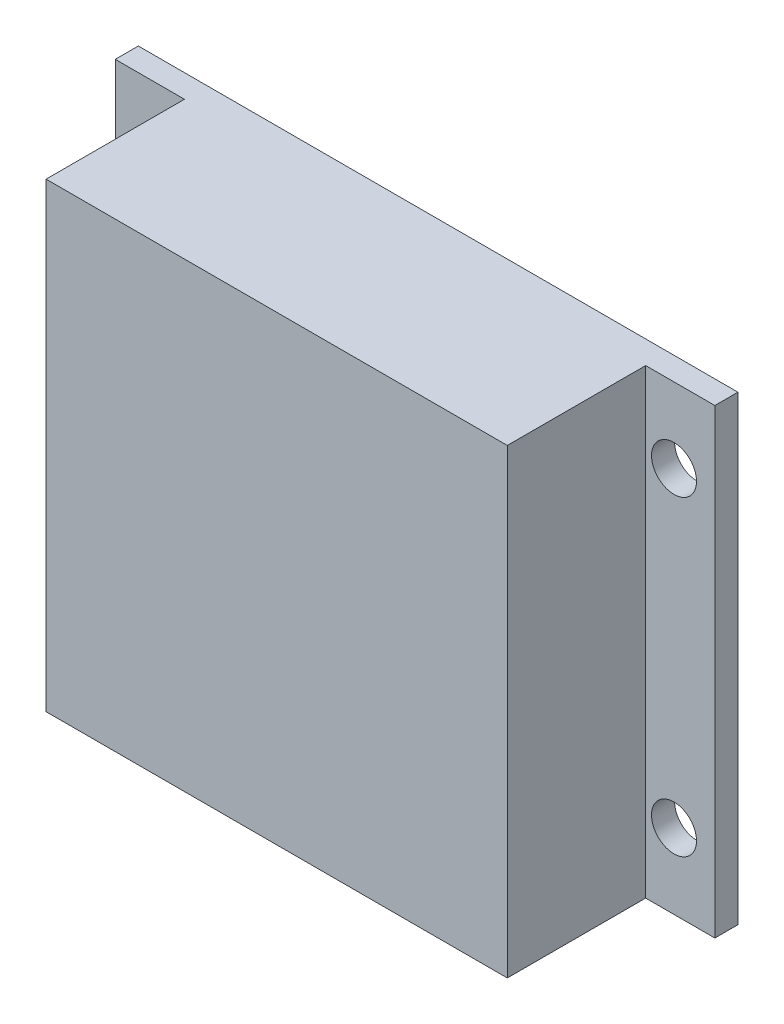
ISO-10303-21;
HEADER;
FILE_DESCRIPTION(('STEP AP214'),'2;1');
FILE_NAME('part.step','',(''),(''),'','','');
FILE_SCHEMA(('AUTOMOTIVE_DESIGN { 1 0 10303 214 1 1 1 1 }'));
ENDSEC;
DATA;
#1=APPLICATION_CONTEXT('core data for automotive mechanical design processes');
#2=APPLICATION_PROTOCOL_DEFINITION('international standard','automotive_design',2000,#1);
#3=PRODUCT_CONTEXT('',#1,'mechanical');
#4=PRODUCT('Part','Part','',(#3));
#5=PRODUCT_RELATED_PRODUCT_CATEGORY('part','',(#4));
#6=PRODUCT_DEFINITION_FORMATION('','',#4);
#7=PRODUCT_DEFINITION_CONTEXT('part definition',#1,'design');
#8=PRODUCT_DEFINITION('design','',#6,#7);
#9=PRODUCT_DEFINITION_SHAPE('','',#8);
#10=(LENGTH_UNIT() NAMED_UNIT(*) SI_UNIT(.MILLI.,.METRE.));
#11=(NAMED_UNIT(*) PLANE_ANGLE_UNIT() SI_UNIT($,.RADIAN.));
#12=(NAMED_UNIT(*) SI_UNIT($,.STERADIAN.) SOLID_ANGLE_UNIT());
#13=UNCERTAINTY_MEASURE_WITH_UNIT(LENGTH_MEASURE(1.E-05),#10,'distance_accuracy_value','');
#14=(GEOMETRIC_REPRESENTATION_CONTEXT(3) GLOBAL_UNCERTAINTY_ASSIGNED_CONTEXT((#13)) GLOBAL_UNIT_ASSIGNED_CONTEXT((#10,
#11,#12)) REPRESENTATION_CONTEXT('',''));
#15=CARTESIAN_POINT('',(0.,0.,0.));
#16=DIRECTION('',(0.,0.,1.));
#17=DIRECTION('',(1.,0.,0.));
#18=AXIS2_PLACEMENT_3D('',#15,#16,#17);
#19=CARTESIAN_POINT('',(0.,0.,1.));
#20=DIRECTION('',(0.,0.,-1.));
#21=DIRECTION('',(-1.,0.,0.));
#22=AXIS2_PLACEMENT_3D('',#19,#20,#21);
#23=PLANE('',#22);
#24=CARTESIAN_POINT('',(-11.23,-6.75,1.));
#25=DIRECTION('',(0.,0.,-1.));
#26=DIRECTION('',(1.,0.,0.));
#27=AXIS2_PLACEMENT_3D('',#24,#25,#26);
#28=CIRCLE('',#27,0.975);
#29=CARTESIAN_POINT('',(-10.255,-6.75,1.));
#30=VERTEX_POINT('',#29);
#31=EDGE_CURVE('E223',#30,#30,#28,.T.);
#32=ORIENTED_EDGE('',*,*,#31,.T.);
#33=EDGE_LOOP('',(#32));
#34=FACE_BOUND('',#33,.T.);
#35=CARTESIAN_POINT('',(-11.23,6.75,1.));
#36=DIRECTION('',(0.,0.,1.));
#37=DIRECTION('',(1.,0.,0.));
#38=AXIS2_PLACEMENT_3D('',#35,#36,#37);
#39=CIRCLE('',#38,0.975);
#40=CARTESIAN_POINT('',(-10.255,6.75,1.));
#41=VERTEX_POINT('',#40);
#42=EDGE_CURVE('E207',#41,#41,#39,.T.);
#43=ORIENTED_EDGE('',*,*,#42,.F.);
#44=EDGE_LOOP('',(#43));
#45=FACE_BOUND('',#44,.T.);
#46=DIRECTION('',(0.,-1.,0.));
#47=VECTOR('',#46,1.);
#48=CARTESIAN_POINT('',(-10.,-10.,1.));
#49=LINE('',#48,#47);
#50=CARTESIAN_POINT('',(-10.,10.,1.));
#51=VERTEX_POINT('',#50);
#52=CARTESIAN_POINT('',(-10.,-10.,1.));
#53=VERTEX_POINT('',#52);
#54=EDGE_CURVE('E56',#51,#53,#49,.T.);
#55=ORIENTED_EDGE('',*,*,#54,.F.);
#56=DIRECTION('',(-1.,0.,0.));
#57=VECTOR('',#56,1.);
#58=CARTESIAN_POINT('',(13.,10.,1.));
#59=LINE('',#58,#57);
#60=CARTESIAN_POINT('',(-13.,10.,1.));
#61=VERTEX_POINT('',#60);
#62=EDGE_CURVE('E147',#51,#61,#59,.T.);
#63=ORIENTED_EDGE('',*,*,#62,.T.);
#64=DIRECTION('',(0.,1.,0.));
#65=VECTOR('',#64,1.);
#66=CARTESIAN_POINT('',(-13.,-10.,1.));
#67=LINE('',#66,#65);
#68=CARTESIAN_POINT('',(-13.,-10.,1.));
#69=VERTEX_POINT('',#68);
#70=EDGE_CURVE('E143',#69,#61,#67,.T.);
#71=ORIENTED_EDGE('',*,*,#70,.F.);
#72=DIRECTION('',(-1.,0.,0.));
#73=VECTOR('',#72,1.);
#74=CARTESIAN_POINT('',(13.,-10.,1.));
#75=LINE('',#74,#73);
#76=EDGE_CURVE('E61',#53,#69,#75,.T.);
#77=ORIENTED_EDGE('',*,*,#76,.F.);
#78=EDGE_LOOP('',(#55,#63,#71,#77));
#79=FACE_BOUND('',#78,.T.);
#80=ADVANCED_FACE('F38',(#34,#45,#79),#23,.F.);
#81=CARTESIAN_POINT('',(11.23,-6.75,1.));
#82=DIRECTION('',(0.,0.,1.));
#83=DIRECTION('',(-1.,0.,0.));
#84=AXIS2_PLACEMENT_3D('',#81,#82,#83);
#85=CIRCLE('',#84,0.975);
#86=CARTESIAN_POINT('',(10.255,-6.75,1.));
#87=VERTEX_POINT('',#86);
#88=EDGE_CURVE('E231',#87,#87,#85,.T.);
#89=ORIENTED_EDGE('',*,*,#88,.F.);
#90=EDGE_LOOP('',(#89));
#91=FACE_BOUND('',#90,.T.);
#92=CARTESIAN_POINT('',(11.23,6.75,1.));
#93=DIRECTION('',(0.,0.,-1.));
#94=DIRECTION('',(-1.,0.,0.));
#95=AXIS2_PLACEMENT_3D('',#92,#93,#94);
#96=CIRCLE('',#95,0.975);
#97=CARTESIAN_POINT('',(10.255,6.75,1.));
#98=VERTEX_POINT('',#97);
#99=EDGE_CURVE('E215',#98,#98,#96,.T.);
#100=ORIENTED_EDGE('',*,*,#99,.T.);
#101=EDGE_LOOP('',(#100));
#102=FACE_BOUND('',#101,.T.);
#103=DIRECTION('',(0.,1.,0.));
#104=VECTOR('',#103,1.);
#105=CARTESIAN_POINT('',(10.,-10.,1.));
#106=LINE('',#105,#104);
#107=CARTESIAN_POINT('',(10.,-10.,1.));
#108=VERTEX_POINT('',#107);
#109=CARTESIAN_POINT('',(10.,10.,1.));
#110=VERTEX_POINT('',#109);
#111=EDGE_CURVE('E125',#108,#110,#106,.T.);
#112=ORIENTED_EDGE('',*,*,#111,.F.);
#113=CARTESIAN_POINT('',(13.,-10.,1.));
#114=VERTEX_POINT('',#113);
#115=EDGE_CURVE('E140',#114,#108,#75,.T.);
#116=ORIENTED_EDGE('',*,*,#115,.F.);
#117=DIRECTION('',(0.,1.,0.));
#118=VECTOR('',#117,1.);
#119=CARTESIAN_POINT('',(13.,-10.,1.));
#120=LINE('',#119,#118);
#121=CARTESIAN_POINT('',(13.,10.,1.));
#122=VERTEX_POINT('',#121);
#123=EDGE_CURVE('E151',#114,#122,#120,.T.);
#124=ORIENTED_EDGE('',*,*,#123,.T.);
#125=EDGE_CURVE('E148',#122,#110,#59,.T.);
#126=ORIENTED_EDGE('',*,*,#125,.T.);
#127=EDGE_LOOP('',(#112,#116,#124,#126));
#128=FACE_BOUND('',#127,.T.);
#129=ADVANCED_FACE('F189',(#91,#102,#128),#23,.F.);
#130=CARTESIAN_POINT('',(13.,-10.,1.));
#131=DIRECTION('',(0.,-1.,0.));
#132=DIRECTION('',(1.,0.,0.));
#133=AXIS2_PLACEMENT_3D('',#130,#131,#132);
#134=PLANE('',#133);
#135=DIRECTION('',(-1.,0.,0.));
#136=VECTOR('',#135,1.);
#137=CARTESIAN_POINT('',(13.,-10.,0.));
#138=LINE('',#137,#136);
#139=CARTESIAN_POINT('',(13.,-10.,0.));
#140=VERTEX_POINT('',#139);
#141=CARTESIAN_POINT('',(-13.,-10.,0.));
#142=VERTEX_POINT('',#141);
#143=EDGE_CURVE('E129',#140,#142,#138,.T.);
#144=ORIENTED_EDGE('',*,*,#143,.F.);
#145=DIRECTION('',(0.,0.,-1.));
#146=VECTOR('',#145,1.);
#147=CARTESIAN_POINT('',(13.,-10.,1.));
#148=LINE('',#147,#146);
#149=EDGE_CURVE('E11',#114,#140,#148,.T.);
#150=ORIENTED_EDGE('',*,*,#149,.F.);
#151=ORIENTED_EDGE('',*,*,#115,.T.);
#152=DIRECTION('',(0.,0.,-1.));
#153=VECTOR('',#152,1.);
#154=CARTESIAN_POINT('',(10.,-10.,7.));
#155=LINE('',#154,#153);
#156=CARTESIAN_POINT('',(10.,-10.,7.));
#157=VERTEX_POINT('',#156);
#158=EDGE_CURVE('E110',#157,#108,#155,.T.);
#159=ORIENTED_EDGE('',*,*,#158,.F.);
#160=DIRECTION('',(1.,0.,0.));
#161=VECTOR('',#160,1.);
#162=CARTESIAN_POINT('',(10.,-10.,7.));
#163=LINE('',#162,#161);
#164=CARTESIAN_POINT('',(-10.,-10.,7.));
#165=VERTEX_POINT('',#164);
#166=EDGE_CURVE('E103',#165,#157,#163,.T.);
#167=ORIENTED_EDGE('',*,*,#166,.F.);
#168=DIRECTION('',(0.,0.,-1.));
#169=VECTOR('',#168,1.);
#170=CARTESIAN_POINT('',(-10.,-10.,7.));
#171=LINE('',#170,#169);
#172=EDGE_CURVE('E107',#165,#53,#171,.T.);
#173=ORIENTED_EDGE('',*,*,#172,.T.);
#174=ORIENTED_EDGE('',*,*,#76,.T.);
#175=DIRECTION('',(0.,0.,-1.));
#176=VECTOR('',#175,1.);
#177=CARTESIAN_POINT('',(-13.,-10.,1.));
#178=LINE('',#177,#176);
#179=EDGE_CURVE('E42',#69,#142,#178,.T.);
#180=ORIENTED_EDGE('',*,*,#179,.T.);
#181=EDGE_LOOP('',(#144,#150,#151,#159,#167,#173,#174,#180));
#182=FACE_BOUND('',#181,.T.);
#183=ADVANCED_FACE('F40',(#182),#134,.T.);
#184=CARTESIAN_POINT('',(13.,-10.,1.));
#185=DIRECTION('',(-1.,0.,0.));
#186=DIRECTION('',(0.,0.,1.));
#187=AXIS2_PLACEMENT_3D('',#184,#185,#186);
#188=PLANE('',#187);
#189=DIRECTION('',(0.,1.,0.));
#190=VECTOR('',#189,1.);
#191=CARTESIAN_POINT('',(13.,-10.,0.));
#192=LINE('',#191,#190);
#193=CARTESIAN_POINT('',(13.,10.,0.));
#194=VERTEX_POINT('',#193);
#195=EDGE_CURVE('E161',#140,#194,#192,.T.);
#196=ORIENTED_EDGE('',*,*,#195,.T.);
#197=DIRECTION('',(0.,0.,-1.));
#198=VECTOR('',#197,1.);
#199=CARTESIAN_POINT('',(13.,10.,1.));
#200=LINE('',#199,#198);
#201=EDGE_CURVE('E48',#122,#194,#200,.T.);
#202=ORIENTED_EDGE('',*,*,#201,.F.);
#203=ORIENTED_EDGE('',*,*,#123,.F.);
#204=ORIENTED_EDGE('',*,*,#149,.T.);
#205=EDGE_LOOP('',(#196,#202,#203,#204));
#206=FACE_BOUND('',#205,.T.);
#207=ADVANCED_FACE('F180',(#206),#188,.F.);
#208=CARTESIAN_POINT('',(13.,10.,1.));
#209=DIRECTION('',(0.,-1.,0.));
#210=DIRECTION('',(1.,0.,0.));
#211=AXIS2_PLACEMENT_3D('',#208,#209,#210);
#212=PLANE('',#211);
#213=DIRECTION('',(-1.,0.,0.));
#214=VECTOR('',#213,1.);
#215=CARTESIAN_POINT('',(13.,10.,0.));
#216=LINE('',#215,#214);
#217=CARTESIAN_POINT('',(-13.,10.,0.));
#218=VERTEX_POINT('',#217);
#219=EDGE_CURVE('E157',#194,#218,#216,.T.);
#220=ORIENTED_EDGE('',*,*,#219,.T.);
#221=DIRECTION('',(0.,0.,-1.));
#222=VECTOR('',#221,1.);
#223=CARTESIAN_POINT('',(-13.,10.,1.));
#224=LINE('',#223,#222);
#225=EDGE_CURVE('E166',#61,#218,#224,.T.);
#226=ORIENTED_EDGE('',*,*,#225,.F.);
#227=ORIENTED_EDGE('',*,*,#62,.F.);
#228=DIRECTION('',(0.,0.,-1.));
#229=VECTOR('',#228,1.);
#230=CARTESIAN_POINT('',(-10.,10.,7.));
#231=LINE('',#230,#229);
#232=CARTESIAN_POINT('',(-10.,10.,7.));
#233=VERTEX_POINT('',#232);
#234=EDGE_CURVE('E200',#233,#51,#231,.T.);
#235=ORIENTED_EDGE('',*,*,#234,.F.);
#236=DIRECTION('',(-1.,0.,0.));
#237=VECTOR('',#236,1.);
#238=CARTESIAN_POINT('',(10.,10.,7.));
#239=LINE('',#238,#237);
#240=CARTESIAN_POINT('',(10.,10.,7.));
#241=VERTEX_POINT('',#240);
#242=EDGE_CURVE('E120',#241,#233,#239,.T.);
#243=ORIENTED_EDGE('',*,*,#242,.F.);
#244=DIRECTION('',(0.,0.,-1.));
#245=VECTOR('',#244,1.);
#246=CARTESIAN_POINT('',(10.,10.,7.));
#247=LINE('',#246,#245);
#248=EDGE_CURVE('E136',#241,#110,#247,.T.);
#249=ORIENTED_EDGE('',*,*,#248,.T.);
#250=ORIENTED_EDGE('',*,*,#125,.F.);
#251=ORIENTED_EDGE('',*,*,#201,.T.);
#252=EDGE_LOOP('',(#220,#226,#227,#235,#243,#249,#250,#251));
#253=FACE_BOUND('',#252,.T.);
#254=ADVANCED_FACE('F184',(#253),#212,.F.);
#255=CARTESIAN_POINT('',(-13.,-10.,1.));
#256=DIRECTION('',(-1.,0.,0.));
#257=DIRECTION('',(0.,0.,1.));
#258=AXIS2_PLACEMENT_3D('',#255,#256,#257);
#259=PLANE('',#258);
#260=DIRECTION('',(0.,1.,0.));
#261=VECTOR('',#260,1.);
#262=CARTESIAN_POINT('',(-13.,-10.,0.));
#263=LINE('',#262,#261);
#264=EDGE_CURVE('E134',#142,#218,#263,.T.);
#265=ORIENTED_EDGE('',*,*,#264,.F.);
#266=ORIENTED_EDGE('',*,*,#179,.F.);
#267=ORIENTED_EDGE('',*,*,#70,.T.);
#268=ORIENTED_EDGE('',*,*,#225,.T.);
#269=EDGE_LOOP('',(#265,#266,#267,#268));
#270=FACE_BOUND('',#269,.T.);
#271=ADVANCED_FACE('F173',(#270),#259,.T.);
#272=CARTESIAN_POINT('',(0.,0.,0.));
#273=DIRECTION('',(0.,0.,-1.));
#274=DIRECTION('',(-1.,0.,0.));
#275=AXIS2_PLACEMENT_3D('',#272,#273,#274);
#276=PLANE('',#275);
#277=CARTESIAN_POINT('',(11.23,-6.75,0.));
#278=DIRECTION('',(0.,0.,1.));
#279=DIRECTION('',(-1.,0.,0.));
#280=AXIS2_PLACEMENT_3D('',#277,#278,#279);
#281=CIRCLE('',#280,0.975);
#282=CARTESIAN_POINT('',(10.255,-6.75,0.));
#283=VERTEX_POINT('',#282);
#284=EDGE_CURVE('E227',#283,#283,#281,.T.);
#285=ORIENTED_EDGE('',*,*,#284,.T.);
#286=EDGE_LOOP('',(#285));
#287=FACE_BOUND('',#286,.T.);
#288=CARTESIAN_POINT('',(-11.23,-6.75,0.));
#289=DIRECTION('',(0.,0.,-1.));
#290=DIRECTION('',(1.,0.,0.));
#291=AXIS2_PLACEMENT_3D('',#288,#289,#290);
#292=CIRCLE('',#291,0.975);
#293=CARTESIAN_POINT('',(-10.255,-6.75,0.));
#294=VERTEX_POINT('',#293);
#295=EDGE_CURVE('E219',#294,#294,#292,.T.);
#296=ORIENTED_EDGE('',*,*,#295,.F.);
#297=EDGE_LOOP('',(#296));
#298=FACE_BOUND('',#297,.T.);
#299=CARTESIAN_POINT('',(11.23,6.75,0.));
#300=DIRECTION('',(0.,0.,-1.));
#301=DIRECTION('',(-1.,0.,0.));
#302=AXIS2_PLACEMENT_3D('',#299,#300,#301);
#303=CIRCLE('',#302,0.975);
#304=CARTESIAN_POINT('',(10.255,6.75,0.));
#305=VERTEX_POINT('',#304);
#306=EDGE_CURVE('E211',#305,#305,#303,.T.);
#307=ORIENTED_EDGE('',*,*,#306,.F.);
#308=EDGE_LOOP('',(#307));
#309=FACE_BOUND('',#308,.T.);
#310=CARTESIAN_POINT('',(-11.23,6.75,0.));
#311=DIRECTION('',(0.,0.,1.));
#312=DIRECTION('',(1.,0.,0.));
#313=AXIS2_PLACEMENT_3D('',#310,#311,#312);
#314=CIRCLE('',#313,0.975);
#315=CARTESIAN_POINT('',(-10.255,6.75,0.));
#316=VERTEX_POINT('',#315);
#317=EDGE_CURVE('E196',#316,#316,#314,.T.);
#318=ORIENTED_EDGE('',*,*,#317,.T.);
#319=EDGE_LOOP('',(#318));
#320=FACE_BOUND('',#319,.T.);
#321=ORIENTED_EDGE('',*,*,#143,.T.);
#322=ORIENTED_EDGE('',*,*,#264,.T.);
#323=ORIENTED_EDGE('',*,*,#219,.F.);
#324=ORIENTED_EDGE('',*,*,#195,.F.);
#325=EDGE_LOOP('',(#321,#322,#323,#324));
#326=FACE_BOUND('',#325,.T.);
#327=ADVANCED_FACE('F177',(#287,#298,#309,#320,#326),#276,.T.);
#328=CARTESIAN_POINT('',(-10.,-10.,7.));
#329=DIRECTION('',(1.,0.,0.));
#330=DIRECTION('',(0.,0.,-1.));
#331=AXIS2_PLACEMENT_3D('',#328,#329,#330);
#332=PLANE('',#331);
#333=ORIENTED_EDGE('',*,*,#54,.T.);
#334=ORIENTED_EDGE('',*,*,#172,.F.);
#335=DIRECTION('',(0.,-1.,0.));
#336=VECTOR('',#335,1.);
#337=CARTESIAN_POINT('',(-10.,-10.,7.));
#338=LINE('',#337,#336);
#339=EDGE_CURVE('E115',#233,#165,#338,.T.);
#340=ORIENTED_EDGE('',*,*,#339,.F.);
#341=ORIENTED_EDGE('',*,*,#234,.T.);
#342=EDGE_LOOP('',(#333,#334,#340,#341));
#343=FACE_BOUND('',#342,.T.);
#344=ADVANCED_FACE('F127',(#343),#332,.F.);
#345=CARTESIAN_POINT('',(10.,-10.,7.));
#346=DIRECTION('',(-1.,0.,0.));
#347=DIRECTION('',(0.,0.,1.));
#348=AXIS2_PLACEMENT_3D('',#345,#346,#347);
#349=PLANE('',#348);
#350=ORIENTED_EDGE('',*,*,#111,.T.);
#351=ORIENTED_EDGE('',*,*,#248,.F.);
#352=DIRECTION('',(0.,1.,0.));
#353=VECTOR('',#352,1.);
#354=CARTESIAN_POINT('',(10.,-10.,7.));
#355=LINE('',#354,#353);
#356=EDGE_CURVE('E114',#157,#241,#355,.T.);
#357=ORIENTED_EDGE('',*,*,#356,.F.);
#358=ORIENTED_EDGE('',*,*,#158,.T.);
#359=EDGE_LOOP('',(#350,#351,#357,#358));
#360=FACE_BOUND('',#359,.T.);
#361=ADVANCED_FACE('F192',(#360),#349,.F.);
#362=CARTESIAN_POINT('',(0.,0.,7.));
#363=DIRECTION('',(0.,0.,1.));
#364=DIRECTION('',(1.,0.,0.));
#365=AXIS2_PLACEMENT_3D('',#362,#363,#364);
#366=PLANE('',#365);
#367=ORIENTED_EDGE('',*,*,#339,.T.);
#368=ORIENTED_EDGE('',*,*,#166,.T.);
#369=ORIENTED_EDGE('',*,*,#356,.T.);
#370=ORIENTED_EDGE('',*,*,#242,.T.);
#371=EDGE_LOOP('',(#367,#368,#369,#370));
#372=FACE_BOUND('',#371,.T.);
#373=ADVANCED_FACE('F118',(#372),#366,.T.);
#374=CARTESIAN_POINT('',(-11.23,6.75,0.));
#375=DIRECTION('',(0.,0.,1.));
#376=DIRECTION('',(1.,0.,0.));
#377=AXIS2_PLACEMENT_3D('',#374,#375,#376);
#378=CYLINDRICAL_SURFACE('',#377,0.975);
#379=ORIENTED_EDGE('',*,*,#317,.F.);
#380=EDGE_LOOP('',(#379));
#381=FACE_BOUND('',#380,.T.);
#382=ORIENTED_EDGE('',*,*,#42,.T.);
#383=EDGE_LOOP('',(#382));
#384=FACE_BOUND('',#383,.T.);
#385=ADVANCED_FACE('F255',(#381,#384),#378,.F.);
#386=CARTESIAN_POINT('',(11.23,6.75,0.));
#387=DIRECTION('',(0.,0.,1.));
#388=DIRECTION('',(1.,0.,0.));
#389=AXIS2_PLACEMENT_3D('',#386,#387,#388);
#390=CYLINDRICAL_SURFACE('',#389,0.975);
#391=ORIENTED_EDGE('',*,*,#306,.T.);
#392=EDGE_LOOP('',(#391));
#393=FACE_BOUND('',#392,.T.);
#394=ORIENTED_EDGE('',*,*,#99,.F.);
#395=EDGE_LOOP('',(#394));
#396=FACE_BOUND('',#395,.T.);
#397=ADVANCED_FACE('F253',(#393,#396),#390,.F.);
#398=CARTESIAN_POINT('',(-11.23,-6.75,0.));
#399=DIRECTION('',(0.,0.,1.));
#400=DIRECTION('',(1.,0.,0.));
#401=AXIS2_PLACEMENT_3D('',#398,#399,#400);
#402=CYLINDRICAL_SURFACE('',#401,0.975);
#403=ORIENTED_EDGE('',*,*,#295,.T.);
#404=EDGE_LOOP('',(#403));
#405=FACE_BOUND('',#404,.T.);
#406=ORIENTED_EDGE('',*,*,#31,.F.);
#407=EDGE_LOOP('',(#406));
#408=FACE_BOUND('',#407,.T.);
#409=ADVANCED_FACE('F244',(#405,#408),#402,.F.);
#410=CARTESIAN_POINT('',(11.23,-6.75,0.));
#411=DIRECTION('',(0.,0.,1.));
#412=DIRECTION('',(1.,0.,0.));
#413=AXIS2_PLACEMENT_3D('',#410,#411,#412);
#414=CYLINDRICAL_SURFACE('',#413,0.975);
#415=ORIENTED_EDGE('',*,*,#284,.F.);
#416=EDGE_LOOP('',(#415));
#417=FACE_BOUND('',#416,.T.);
#418=ORIENTED_EDGE('',*,*,#88,.T.);
#419=EDGE_LOOP('',(#418));
#420=FACE_BOUND('',#419,.T.);
#421=ADVANCED_FACE('F241',(#417,#420),#414,.F.);
#422=CLOSED_SHELL('',(#80,#129,#183,#207,#254,#271,#327,#344,#361,#373,#385,#397,#409,#421));
#423=MANIFOLD_SOLID_BREP('B2',#422);
#424=ADVANCED_BREP_SHAPE_REPRESENTATION('',(#18,#423),#14);
#425=SHAPE_DEFINITION_REPRESENTATION(#9,#424);
ENDSEC;
END-ISO-10303-21;
